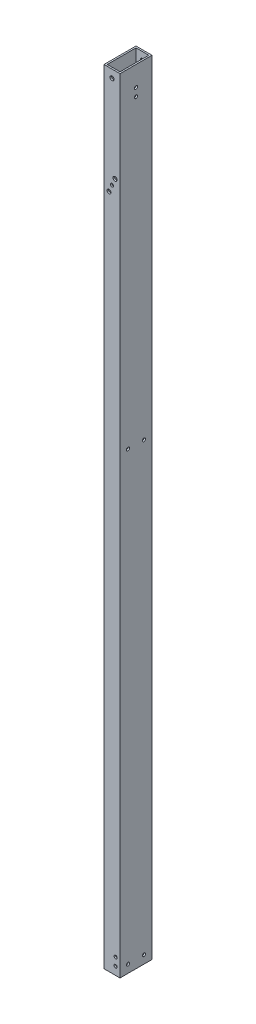
ISO-10303-21;
HEADER;
FILE_DESCRIPTION(('STEP AP214'),'2;1');
FILE_NAME('part.step','',(''),(''),'','','');
FILE_SCHEMA(('AUTOMOTIVE_DESIGN { 1 0 10303 214 1 1 1 1 }'));
ENDSEC;
DATA;
#1=APPLICATION_CONTEXT('core data for automotive mechanical design processes');
#2=APPLICATION_PROTOCOL_DEFINITION('international standard','automotive_design',2000,#1);
#3=PRODUCT_CONTEXT('',#1,'mechanical');
#4=PRODUCT('Part','Part','',(#3));
#5=PRODUCT_RELATED_PRODUCT_CATEGORY('part','',(#4));
#6=PRODUCT_DEFINITION_FORMATION('','',#4);
#7=PRODUCT_DEFINITION_CONTEXT('part definition',#1,'design');
#8=PRODUCT_DEFINITION('design','',#6,#7);
#9=PRODUCT_DEFINITION_SHAPE('','',#8);
#10=(LENGTH_UNIT() NAMED_UNIT(*) SI_UNIT(.MILLI.,.METRE.));
#11=(NAMED_UNIT(*) PLANE_ANGLE_UNIT() SI_UNIT($,.RADIAN.));
#12=(NAMED_UNIT(*) SI_UNIT($,.STERADIAN.) SOLID_ANGLE_UNIT());
#13=UNCERTAINTY_MEASURE_WITH_UNIT(LENGTH_MEASURE(1.E-05),#10,'distance_accuracy_value','');
#14=(GEOMETRIC_REPRESENTATION_CONTEXT(3) GLOBAL_UNCERTAINTY_ASSIGNED_CONTEXT((#13)) GLOBAL_UNIT_ASSIGNED_CONTEXT((#10,
#11,#12)) REPRESENTATION_CONTEXT('',''));
#15=CARTESIAN_POINT('',(0.,0.,0.));
#16=DIRECTION('',(0.,0.,1.));
#17=DIRECTION('',(1.,0.,0.));
#18=AXIS2_PLACEMENT_3D('',#15,#16,#17);
#19=CARTESIAN_POINT('',(0.,1244.6,0.));
#20=DIRECTION('',(0.,1.,0.));
#21=DIRECTION('',(0.,0.,1.));
#22=AXIS2_PLACEMENT_3D('',#19,#20,#21);
#23=PLANE('',#22);
#24=DIRECTION('',(0.,0.,1.));
#25=VECTOR('',#24,1.);
#26=CARTESIAN_POINT('',(0.,1244.6,0.));
#27=LINE('',#26,#25);
#28=CARTESIAN_POINT('',(0.,1244.6,-50.8));
#29=VERTEX_POINT('',#28);
#30=CARTESIAN_POINT('',(0.,1244.6,0.));
#31=VERTEX_POINT('',#30);
#32=EDGE_CURVE('E161',#29,#31,#27,.T.);
#33=ORIENTED_EDGE('',*,*,#32,.T.);
#34=DIRECTION('',(1.,0.,0.));
#35=VECTOR('',#34,1.);
#36=CARTESIAN_POINT('',(0.,1244.6,0.));
#37=LINE('',#36,#35);
#38=CARTESIAN_POINT('',(25.4,1244.6,0.));
#39=VERTEX_POINT('',#38);
#40=EDGE_CURVE('E164',#31,#39,#37,.T.);
#41=ORIENTED_EDGE('',*,*,#40,.T.);
#42=DIRECTION('',(0.,0.,-1.));
#43=VECTOR('',#42,1.);
#44=CARTESIAN_POINT('',(25.4,1244.6,0.));
#45=LINE('',#44,#43);
#46=CARTESIAN_POINT('',(25.4,1244.6,-50.8));
#47=VERTEX_POINT('',#46);
#48=EDGE_CURVE('E167',#39,#47,#45,.T.);
#49=ORIENTED_EDGE('',*,*,#48,.T.);
#50=DIRECTION('',(-1.,0.,0.));
#51=VECTOR('',#50,1.);
#52=CARTESIAN_POINT('',(0.,1244.6,-50.8));
#53=LINE('',#52,#51);
#54=EDGE_CURVE('E169',#47,#29,#53,.T.);
#55=ORIENTED_EDGE('',*,*,#54,.T.);
#56=EDGE_LOOP('',(#33,#41,#49,#55));
#57=FACE_BOUND('',#56,.T.);
#58=DIRECTION('',(1.,0.,0.));
#59=VECTOR('',#58,1.);
#60=CARTESIAN_POINT('',(0.,1244.6,-2.54));
#61=LINE('',#60,#59);
#62=CARTESIAN_POINT('',(2.54,1244.6,-2.54));
#63=VERTEX_POINT('',#62);
#64=CARTESIAN_POINT('',(22.86,1244.6,-2.54));
#65=VERTEX_POINT('',#64);
#66=EDGE_CURVE('E131',#63,#65,#61,.T.);
#67=ORIENTED_EDGE('',*,*,#66,.F.);
#68=DIRECTION('',(0.,0.,1.));
#69=VECTOR('',#68,1.);
#70=CARTESIAN_POINT('',(2.54,1244.6,0.));
#71=LINE('',#70,#69);
#72=CARTESIAN_POINT('',(2.54,1244.6,-48.26));
#73=VERTEX_POINT('',#72);
#74=EDGE_CURVE('E123',#73,#63,#71,.T.);
#75=ORIENTED_EDGE('',*,*,#74,.F.);
#76=DIRECTION('',(-1.,0.,0.));
#77=VECTOR('',#76,1.);
#78=CARTESIAN_POINT('',(0.,1244.6,-48.26));
#79=LINE('',#78,#77);
#80=CARTESIAN_POINT('',(22.86,1244.6,-48.26));
#81=VERTEX_POINT('',#80);
#82=EDGE_CURVE('E145',#81,#73,#79,.T.);
#83=ORIENTED_EDGE('',*,*,#82,.F.);
#84=DIRECTION('',(0.,0.,-1.));
#85=VECTOR('',#84,1.);
#86=CARTESIAN_POINT('',(22.86,1244.6,0.));
#87=LINE('',#86,#85);
#88=EDGE_CURVE('E143',#65,#81,#87,.T.);
#89=ORIENTED_EDGE('',*,*,#88,.F.);
#90=EDGE_LOOP('',(#67,#75,#83,#89));
#91=FACE_BOUND('',#90,.T.);
#92=ADVANCED_FACE('F56',(#57,#91),#23,.T.);
#93=CARTESIAN_POINT('',(0.,0.,0.));
#94=DIRECTION('',(0.,1.,0.));
#95=DIRECTION('',(0.,0.,1.));
#96=AXIS2_PLACEMENT_3D('',#93,#94,#95);
#97=PLANE('',#96);
#98=DIRECTION('',(0.,0.,1.));
#99=VECTOR('',#98,1.);
#100=CARTESIAN_POINT('',(0.,0.,0.));
#101=LINE('',#100,#99);
#102=CARTESIAN_POINT('',(0.,0.,-50.8));
#103=VERTEX_POINT('',#102);
#104=CARTESIAN_POINT('',(0.,0.,0.));
#105=VERTEX_POINT('',#104);
#106=EDGE_CURVE('E139',#103,#105,#101,.T.);
#107=ORIENTED_EDGE('',*,*,#106,.F.);
#108=DIRECTION('',(-1.,0.,0.));
#109=VECTOR('',#108,1.);
#110=CARTESIAN_POINT('',(0.,0.,-50.8));
#111=LINE('',#110,#109);
#112=CARTESIAN_POINT('',(25.4,0.,-50.8));
#113=VERTEX_POINT('',#112);
#114=EDGE_CURVE('E165',#113,#103,#111,.T.);
#115=ORIENTED_EDGE('',*,*,#114,.F.);
#116=DIRECTION('',(0.,0.,-1.));
#117=VECTOR('',#116,1.);
#118=CARTESIAN_POINT('',(25.4,0.,0.));
#119=LINE('',#118,#117);
#120=CARTESIAN_POINT('',(25.4,0.,0.));
#121=VERTEX_POINT('',#120);
#122=EDGE_CURVE('E176',#121,#113,#119,.T.);
#123=ORIENTED_EDGE('',*,*,#122,.F.);
#124=DIRECTION('',(1.,0.,0.));
#125=VECTOR('',#124,1.);
#126=CARTESIAN_POINT('',(0.,0.,0.));
#127=LINE('',#126,#125);
#128=EDGE_CURVE('E174',#105,#121,#127,.T.);
#129=ORIENTED_EDGE('',*,*,#128,.F.);
#130=EDGE_LOOP('',(#107,#115,#123,#129));
#131=FACE_BOUND('',#130,.T.);
#132=DIRECTION('',(0.,0.,1.));
#133=VECTOR('',#132,1.);
#134=CARTESIAN_POINT('',(2.54,0.,0.));
#135=LINE('',#134,#133);
#136=CARTESIAN_POINT('',(2.54,0.,-48.26));
#137=VERTEX_POINT('',#136);
#138=CARTESIAN_POINT('',(2.54,0.,-2.54));
#139=VERTEX_POINT('',#138);
#140=EDGE_CURVE('E81',#137,#139,#135,.T.);
#141=ORIENTED_EDGE('',*,*,#140,.T.);
#142=DIRECTION('',(1.,0.,0.));
#143=VECTOR('',#142,1.);
#144=CARTESIAN_POINT('',(0.,0.,-2.54));
#145=LINE('',#144,#143);
#146=CARTESIAN_POINT('',(22.86,0.,-2.54));
#147=VERTEX_POINT('',#146);
#148=EDGE_CURVE('E138',#139,#147,#145,.T.);
#149=ORIENTED_EDGE('',*,*,#148,.T.);
#150=DIRECTION('',(0.,0.,-1.));
#151=VECTOR('',#150,1.);
#152=CARTESIAN_POINT('',(22.86,0.,0.));
#153=LINE('',#152,#151);
#154=CARTESIAN_POINT('',(22.86,0.,-48.26));
#155=VERTEX_POINT('',#154);
#156=EDGE_CURVE('E153',#147,#155,#153,.T.);
#157=ORIENTED_EDGE('',*,*,#156,.T.);
#158=DIRECTION('',(-1.,0.,0.));
#159=VECTOR('',#158,1.);
#160=CARTESIAN_POINT('',(0.,0.,-48.26));
#161=LINE('',#160,#159);
#162=EDGE_CURVE('E132',#155,#137,#161,.T.);
#163=ORIENTED_EDGE('',*,*,#162,.T.);
#164=EDGE_LOOP('',(#141,#149,#157,#163));
#165=FACE_BOUND('',#164,.T.);
#166=ADVANCED_FACE('F355',(#131,#165),#97,.F.);
#167=CARTESIAN_POINT('',(0.,1244.6,0.));
#168=DIRECTION('',(1.,0.,0.));
#169=DIRECTION('',(0.,0.,-1.));
#170=AXIS2_PLACEMENT_3D('',#167,#168,#169);
#171=PLANE('',#170);
#172=CARTESIAN_POINT('',(0.,1200.15,-25.3999999999999));
#173=DIRECTION('',(-1.,0.,0.));
#174=DIRECTION('',(0.,0.,1.));
#175=AXIS2_PLACEMENT_3D('',#172,#173,#174);
#176=CIRCLE('',#175,2.48920000000002);
#177=CARTESIAN_POINT('',(0.,1200.15,-22.9107999999999));
#178=VERTEX_POINT('',#177);
#179=EDGE_CURVE('E286',#178,#178,#176,.T.);
#180=ORIENTED_EDGE('',*,*,#179,.F.);
#181=EDGE_LOOP('',(#180));
#182=FACE_BOUND('',#181,.T.);
#183=CARTESIAN_POINT('',(0.,1212.85,-25.3999999999999));
#184=DIRECTION('',(-1.,0.,0.));
#185=DIRECTION('',(0.,0.,1.));
#186=AXIS2_PLACEMENT_3D('',#183,#184,#185);
#187=CIRCLE('',#186,2.48920000000002);
#188=CARTESIAN_POINT('',(0.,1212.85,-22.9107999999999));
#189=VERTEX_POINT('',#188);
#190=EDGE_CURVE('E283',#189,#189,#187,.T.);
#191=ORIENTED_EDGE('',*,*,#190,.F.);
#192=EDGE_LOOP('',(#191));
#193=FACE_BOUND('',#192,.T.);
#194=CARTESIAN_POINT('',(0.,12.9601933725221,-38.1));
#195=DIRECTION('',(1.,0.,0.));
#196=DIRECTION('',(0.,0.,-1.));
#197=AXIS2_PLACEMENT_3D('',#194,#195,#196);
#198=CIRCLE('',#197,2.48919999999988);
#199=CARTESIAN_POINT('',(0.,12.9601933725221,-40.5891999999999));
#200=VERTEX_POINT('',#199);
#201=EDGE_CURVE('E305',#200,#200,#198,.T.);
#202=ORIENTED_EDGE('',*,*,#201,.T.);
#203=EDGE_LOOP('',(#202));
#204=FACE_BOUND('',#203,.T.);
#205=CARTESIAN_POINT('',(0.,721.632068305698,-12.7));
#206=DIRECTION('',(1.,0.,0.));
#207=DIRECTION('',(0.,0.,-1.));
#208=AXIS2_PLACEMENT_3D('',#205,#206,#207);
#209=CIRCLE('',#208,2.50189999999984);
#210=CARTESIAN_POINT('',(0.,721.632068305698,-15.2018999999998));
#211=VERTEX_POINT('',#210);
#212=EDGE_CURVE('E312',#211,#211,#209,.T.);
#213=ORIENTED_EDGE('',*,*,#212,.T.);
#214=EDGE_LOOP('',(#213));
#215=FACE_BOUND('',#214,.T.);
#216=CARTESIAN_POINT('',(0.,721.632068305698,-38.1));
#217=DIRECTION('',(1.,0.,0.));
#218=DIRECTION('',(0.,0.,-1.));
#219=AXIS2_PLACEMENT_3D('',#216,#217,#218);
#220=CIRCLE('',#219,2.50189999999983);
#221=CARTESIAN_POINT('',(0.,721.632068305698,-40.6018999999998));
#222=VERTEX_POINT('',#221);
#223=EDGE_CURVE('E299',#222,#222,#220,.T.);
#224=ORIENTED_EDGE('',*,*,#223,.T.);
#225=EDGE_LOOP('',(#224));
#226=FACE_BOUND('',#225,.T.);
#227=CARTESIAN_POINT('',(0.,12.7000000000001,-12.7));
#228=DIRECTION('',(1.,0.,0.));
#229=DIRECTION('',(0.,0.,-1.));
#230=AXIS2_PLACEMENT_3D('',#227,#228,#229);
#231=CIRCLE('',#230,2.48919999999988);
#232=CARTESIAN_POINT('',(0.,12.7000000000001,-15.1891999999999));
#233=VERTEX_POINT('',#232);
#234=EDGE_CURVE('E190',#233,#233,#231,.T.);
#235=ORIENTED_EDGE('',*,*,#234,.T.);
#236=EDGE_LOOP('',(#235));
#237=FACE_BOUND('',#236,.T.);
#238=ORIENTED_EDGE('',*,*,#106,.T.);
#239=DIRECTION('',(0.,-1.,0.));
#240=VECTOR('',#239,1.);
#241=CARTESIAN_POINT('',(0.,1244.6,0.));
#242=LINE('',#241,#240);
#243=EDGE_CURVE('E12',#31,#105,#242,.T.);
#244=ORIENTED_EDGE('',*,*,#243,.F.);
#245=ORIENTED_EDGE('',*,*,#32,.F.);
#246=DIRECTION('',(0.,-1.,0.));
#247=VECTOR('',#246,1.);
#248=CARTESIAN_POINT('',(0.,1244.6,-50.8));
#249=LINE('',#248,#247);
#250=EDGE_CURVE('E171',#29,#103,#249,.T.);
#251=ORIENTED_EDGE('',*,*,#250,.T.);
#252=EDGE_LOOP('',(#238,#244,#245,#251));
#253=FACE_BOUND('',#252,.T.);
#254=ADVANCED_FACE('F58',(#182,#193,#204,#215,#226,#237,#253),#171,.F.);
#255=CARTESIAN_POINT('',(0.,1244.6,0.));
#256=DIRECTION('',(0.,0.,-1.));
#257=DIRECTION('',(-1.,0.,0.));
#258=AXIS2_PLACEMENT_3D('',#255,#256,#257);
#259=PLANE('',#258);
#260=CARTESIAN_POINT('',(17.4625,1095.9170868,0.));
#261=DIRECTION('',(0.,0.,-1.));
#262=DIRECTION('',(-1.,0.,0.));
#263=AXIS2_PLACEMENT_3D('',#260,#261,#262);
#264=CIRCLE('',#263,3.17500000000003);
#265=CARTESIAN_POINT('',(14.2875,1095.9170868,0.));
#266=VERTEX_POINT('',#265);
#267=EDGE_CURVE('E232',#266,#266,#264,.T.);
#268=ORIENTED_EDGE('',*,*,#267,.T.);
#269=EDGE_LOOP('',(#268));
#270=FACE_BOUND('',#269,.T.);
#271=CARTESIAN_POINT('',(7.9375,1073.6920868,0.));
#272=DIRECTION('',(0.,0.,-1.));
#273=DIRECTION('',(-1.,0.,0.));
#274=AXIS2_PLACEMENT_3D('',#271,#272,#273);
#275=CIRCLE('',#274,3.17500000000003);
#276=CARTESIAN_POINT('',(4.76249999999997,1073.6920868,0.));
#277=VERTEX_POINT('',#276);
#278=EDGE_CURVE('E243',#277,#277,#275,.T.);
#279=ORIENTED_EDGE('',*,*,#278,.T.);
#280=EDGE_LOOP('',(#279));
#281=FACE_BOUND('',#280,.T.);
#282=CARTESIAN_POINT('',(12.7,1231.9,0.));
#283=DIRECTION('',(0.,0.,-1.));
#284=DIRECTION('',(-1.,0.,0.));
#285=AXIS2_PLACEMENT_3D('',#282,#283,#284);
#286=CIRCLE('',#285,3.17500000000009);
#287=CARTESIAN_POINT('',(9.52499999999991,1231.9,0.));
#288=VERTEX_POINT('',#287);
#289=EDGE_CURVE('E228',#288,#288,#286,.T.);
#290=ORIENTED_EDGE('',*,*,#289,.T.);
#291=EDGE_LOOP('',(#290));
#292=FACE_BOUND('',#291,.T.);
#293=CARTESIAN_POINT('',(18.4150000000001,12.6999999999997,0.));
#294=DIRECTION('',(0.,0.,1.));
#295=DIRECTION('',(1.,0.,0.));
#296=AXIS2_PLACEMENT_3D('',#293,#294,#295);
#297=CIRCLE('',#296,2.4892);
#298=CARTESIAN_POINT('',(20.9042000000001,12.6999999999997,0.));
#299=VERTEX_POINT('',#298);
#300=EDGE_CURVE('E264',#299,#299,#297,.T.);
#301=ORIENTED_EDGE('',*,*,#300,.F.);
#302=EDGE_LOOP('',(#301));
#303=FACE_BOUND('',#302,.T.);
#304=CARTESIAN_POINT('',(18.4150000000001,25.3999999999997,0.));
#305=DIRECTION('',(0.,0.,1.));
#306=DIRECTION('',(1.,0.,0.));
#307=AXIS2_PLACEMENT_3D('',#304,#305,#306);
#308=CIRCLE('',#307,2.4892);
#309=CARTESIAN_POINT('',(20.9042000000001,25.3999999999997,0.));
#310=VERTEX_POINT('',#309);
#311=EDGE_CURVE('E261',#310,#310,#308,.T.);
#312=ORIENTED_EDGE('',*,*,#311,.F.);
#313=EDGE_LOOP('',(#312));
#314=FACE_BOUND('',#313,.T.);
#315=CARTESIAN_POINT('',(12.7,1084.8045868,0.));
#316=DIRECTION('',(0.,0.,-1.));
#317=DIRECTION('',(-1.,0.,0.));
#318=AXIS2_PLACEMENT_3D('',#315,#316,#317);
#319=CIRCLE('',#318,2.48920000000001);
#320=CARTESIAN_POINT('',(10.2108,1084.8045868,0.));
#321=VERTEX_POINT('',#320);
#322=EDGE_CURVE('E215',#321,#321,#319,.T.);
#323=ORIENTED_EDGE('',*,*,#322,.T.);
#324=EDGE_LOOP('',(#323));
#325=FACE_BOUND('',#324,.T.);
#326=ORIENTED_EDGE('',*,*,#128,.T.);
#327=DIRECTION('',(0.,-1.,0.));
#328=VECTOR('',#327,1.);
#329=CARTESIAN_POINT('',(25.4,1244.6,0.));
#330=LINE('',#329,#328);
#331=EDGE_CURVE('E65',#39,#121,#330,.T.);
#332=ORIENTED_EDGE('',*,*,#331,.F.);
#333=ORIENTED_EDGE('',*,*,#40,.F.);
#334=ORIENTED_EDGE('',*,*,#243,.T.);
#335=EDGE_LOOP('',(#326,#332,#333,#334));
#336=FACE_BOUND('',#335,.T.);
#337=ADVANCED_FACE('F354',(#270,#281,#292,#303,#314,#325,#336),#259,.F.);
#338=CARTESIAN_POINT('',(25.4,1244.6,0.));
#339=DIRECTION('',(-1.,0.,0.));
#340=DIRECTION('',(0.,0.,1.));
#341=AXIS2_PLACEMENT_3D('',#338,#339,#340);
#342=PLANE('',#341);
#343=CARTESIAN_POINT('',(25.4,1200.15,-25.3999999999999));
#344=DIRECTION('',(-1.,0.,0.));
#345=DIRECTION('',(0.,0.,1.));
#346=AXIS2_PLACEMENT_3D('',#343,#344,#345);
#347=CIRCLE('',#346,2.48920000000002);
#348=CARTESIAN_POINT('',(25.4,1200.15,-22.9107999999999));
#349=VERTEX_POINT('',#348);
#350=EDGE_CURVE('E206',#349,#349,#347,.T.);
#351=ORIENTED_EDGE('',*,*,#350,.T.);
#352=EDGE_LOOP('',(#351));
#353=FACE_BOUND('',#352,.T.);
#354=CARTESIAN_POINT('',(25.4,1212.85,-25.3999999999999));
#355=DIRECTION('',(-1.,0.,0.));
#356=DIRECTION('',(0.,0.,1.));
#357=AXIS2_PLACEMENT_3D('',#354,#355,#356);
#358=CIRCLE('',#357,2.48920000000002);
#359=CARTESIAN_POINT('',(25.4,1212.85,-22.9107999999999));
#360=VERTEX_POINT('',#359);
#361=EDGE_CURVE('E289',#360,#360,#358,.T.);
#362=ORIENTED_EDGE('',*,*,#361,.T.);
#363=EDGE_LOOP('',(#362));
#364=FACE_BOUND('',#363,.T.);
#365=CARTESIAN_POINT('',(25.4,12.9601933725221,-38.1));
#366=DIRECTION('',(1.,0.,0.));
#367=DIRECTION('',(0.,0.,-1.));
#368=AXIS2_PLACEMENT_3D('',#365,#366,#367);
#369=CIRCLE('',#368,2.48919999999988);
#370=CARTESIAN_POINT('',(25.4,12.9601933725221,-40.5891999999999));
#371=VERTEX_POINT('',#370);
#372=EDGE_CURVE('E309',#371,#371,#369,.T.);
#373=ORIENTED_EDGE('',*,*,#372,.F.);
#374=EDGE_LOOP('',(#373));
#375=FACE_BOUND('',#374,.T.);
#376=CARTESIAN_POINT('',(25.4,721.632068305698,-12.7));
#377=DIRECTION('',(1.,0.,0.));
#378=DIRECTION('',(0.,0.,-1.));
#379=AXIS2_PLACEMENT_3D('',#376,#377,#378);
#380=CIRCLE('',#379,2.50189999999984);
#381=CARTESIAN_POINT('',(25.4,721.632068305698,-15.2018999999998));
#382=VERTEX_POINT('',#381);
#383=EDGE_CURVE('E302',#382,#382,#380,.T.);
#384=ORIENTED_EDGE('',*,*,#383,.F.);
#385=EDGE_LOOP('',(#384));
#386=FACE_BOUND('',#385,.T.);
#387=CARTESIAN_POINT('',(25.4,721.632068305698,-38.1));
#388=DIRECTION('',(1.,0.,0.));
#389=DIRECTION('',(0.,0.,-1.));
#390=AXIS2_PLACEMENT_3D('',#387,#388,#389);
#391=CIRCLE('',#390,2.50189999999983);
#392=CARTESIAN_POINT('',(25.4,721.632068305698,-40.6018999999998));
#393=VERTEX_POINT('',#392);
#394=EDGE_CURVE('E298',#393,#393,#391,.T.);
#395=ORIENTED_EDGE('',*,*,#394,.F.);
#396=EDGE_LOOP('',(#395));
#397=FACE_BOUND('',#396,.T.);
#398=CARTESIAN_POINT('',(25.4,12.7000000000001,-12.7));
#399=DIRECTION('',(1.,0.,0.));
#400=DIRECTION('',(0.,0.,-1.));
#401=AXIS2_PLACEMENT_3D('',#398,#399,#400);
#402=CIRCLE('',#401,2.48919999999988);
#403=CARTESIAN_POINT('',(25.4,12.7000000000001,-15.1891999999999));
#404=VERTEX_POINT('',#403);
#405=EDGE_CURVE('E308',#404,#404,#402,.T.);
#406=ORIENTED_EDGE('',*,*,#405,.F.);
#407=EDGE_LOOP('',(#406));
#408=FACE_BOUND('',#407,.T.);
#409=ORIENTED_EDGE('',*,*,#122,.T.);
#410=DIRECTION('',(0.,-1.,0.));
#411=VECTOR('',#410,1.);
#412=CARTESIAN_POINT('',(25.4,1244.6,-50.8));
#413=LINE('',#412,#411);
#414=EDGE_CURVE('E181',#47,#113,#413,.T.);
#415=ORIENTED_EDGE('',*,*,#414,.F.);
#416=ORIENTED_EDGE('',*,*,#48,.F.);
#417=ORIENTED_EDGE('',*,*,#331,.T.);
#418=EDGE_LOOP('',(#409,#415,#416,#417));
#419=FACE_BOUND('',#418,.T.);
#420=ADVANCED_FACE('F373',(#353,#364,#375,#386,#397,#408,#419),#342,.F.);
#421=CARTESIAN_POINT('',(0.,1244.6,-50.8));
#422=DIRECTION('',(0.,0.,1.));
#423=DIRECTION('',(1.,0.,0.));
#424=AXIS2_PLACEMENT_3D('',#421,#422,#423);
#425=PLANE('',#424);
#426=CARTESIAN_POINT('',(17.4625,1095.9170868,-50.8));
#427=DIRECTION('',(0.,0.,-1.));
#428=DIRECTION('',(-1.,0.,0.));
#429=AXIS2_PLACEMENT_3D('',#426,#427,#428);
#430=CIRCLE('',#429,3.17500000000003);
#431=CARTESIAN_POINT('',(14.2875,1095.9170868,-50.8));
#432=VERTEX_POINT('',#431);
#433=EDGE_CURVE('E238',#432,#432,#430,.T.);
#434=ORIENTED_EDGE('',*,*,#433,.F.);
#435=EDGE_LOOP('',(#434));
#436=FACE_BOUND('',#435,.T.);
#437=CARTESIAN_POINT('',(7.9375,1073.6920868,-50.8));
#438=DIRECTION('',(0.,0.,-1.));
#439=DIRECTION('',(-1.,0.,0.));
#440=AXIS2_PLACEMENT_3D('',#437,#438,#439);
#441=CIRCLE('',#440,3.17500000000003);
#442=CARTESIAN_POINT('',(4.76249999999997,1073.6920868,-50.8));
#443=VERTEX_POINT('',#442);
#444=EDGE_CURVE('E248',#443,#443,#441,.T.);
#445=ORIENTED_EDGE('',*,*,#444,.F.);
#446=EDGE_LOOP('',(#445));
#447=FACE_BOUND('',#446,.T.);
#448=CARTESIAN_POINT('',(12.7,1231.9,-50.8));
#449=DIRECTION('',(0.,0.,-1.));
#450=DIRECTION('',(-1.,0.,0.));
#451=AXIS2_PLACEMENT_3D('',#448,#449,#450);
#452=CIRCLE('',#451,3.17500000000009);
#453=CARTESIAN_POINT('',(9.52499999999991,1231.9,-50.8));
#454=VERTEX_POINT('',#453);
#455=EDGE_CURVE('E254',#454,#454,#452,.T.);
#456=ORIENTED_EDGE('',*,*,#455,.F.);
#457=EDGE_LOOP('',(#456));
#458=FACE_BOUND('',#457,.T.);
#459=CARTESIAN_POINT('',(18.4150000000001,12.6999999999997,-50.8));
#460=DIRECTION('',(0.,0.,1.));
#461=DIRECTION('',(1.,0.,0.));
#462=AXIS2_PLACEMENT_3D('',#459,#460,#461);
#463=CIRCLE('',#462,2.4892);
#464=CARTESIAN_POINT('',(20.9042000000001,12.6999999999997,-50.8));
#465=VERTEX_POINT('',#464);
#466=EDGE_CURVE('E220',#465,#465,#463,.T.);
#467=ORIENTED_EDGE('',*,*,#466,.T.);
#468=EDGE_LOOP('',(#467));
#469=FACE_BOUND('',#468,.T.);
#470=CARTESIAN_POINT('',(18.4150000000001,25.3999999999997,-50.8));
#471=DIRECTION('',(0.,0.,1.));
#472=DIRECTION('',(1.,0.,0.));
#473=AXIS2_PLACEMENT_3D('',#470,#471,#472);
#474=CIRCLE('',#473,2.4892);
#475=CARTESIAN_POINT('',(20.9042000000001,25.3999999999997,-50.8));
#476=VERTEX_POINT('',#475);
#477=EDGE_CURVE('E267',#476,#476,#474,.T.);
#478=ORIENTED_EDGE('',*,*,#477,.T.);
#479=EDGE_LOOP('',(#478));
#480=FACE_BOUND('',#479,.T.);
#481=CARTESIAN_POINT('',(12.7,1084.8045868,-50.8));
#482=DIRECTION('',(0.,0.,-1.));
#483=DIRECTION('',(-1.,0.,0.));
#484=AXIS2_PLACEMENT_3D('',#481,#482,#483);
#485=CIRCLE('',#484,2.48920000000001);
#486=CARTESIAN_POINT('',(10.2108,1084.8045868,-50.8));
#487=VERTEX_POINT('',#486);
#488=EDGE_CURVE('E276',#487,#487,#485,.T.);
#489=ORIENTED_EDGE('',*,*,#488,.F.);
#490=EDGE_LOOP('',(#489));
#491=FACE_BOUND('',#490,.T.);
#492=ORIENTED_EDGE('',*,*,#114,.T.);
#493=ORIENTED_EDGE('',*,*,#250,.F.);
#494=ORIENTED_EDGE('',*,*,#54,.F.);
#495=ORIENTED_EDGE('',*,*,#414,.T.);
#496=EDGE_LOOP('',(#492,#493,#494,#495));
#497=FACE_BOUND('',#496,.T.);
#498=ADVANCED_FACE('F334',(#436,#447,#458,#469,#480,#491,#497),#425,.F.);
#499=CARTESIAN_POINT('',(2.54,1244.6,0.));
#500=DIRECTION('',(1.,0.,0.));
#501=DIRECTION('',(0.,0.,-1.));
#502=AXIS2_PLACEMENT_3D('',#499,#500,#501);
#503=PLANE('',#502);
#504=CARTESIAN_POINT('',(2.54,1200.15,-25.3999999999999));
#505=DIRECTION('',(1.,0.,0.));
#506=DIRECTION('',(0.,0.,-1.));
#507=AXIS2_PLACEMENT_3D('',#504,#505,#506);
#508=CIRCLE('',#507,2.48920000000002);
#509=CARTESIAN_POINT('',(2.54,1200.15,-27.8892));
#510=VERTEX_POINT('',#509);
#511=EDGE_CURVE('E210',#510,#510,#508,.T.);
#512=ORIENTED_EDGE('',*,*,#511,.F.);
#513=EDGE_LOOP('',(#512));
#514=FACE_BOUND('',#513,.T.);
#515=CARTESIAN_POINT('',(2.54,1212.85,-25.3999999999999));
#516=DIRECTION('',(1.,0.,0.));
#517=DIRECTION('',(0.,0.,-1.));
#518=AXIS2_PLACEMENT_3D('',#515,#516,#517);
#519=CIRCLE('',#518,2.48920000000002);
#520=CARTESIAN_POINT('',(2.54,1212.85,-27.8892));
#521=VERTEX_POINT('',#520);
#522=EDGE_CURVE('E205',#521,#521,#519,.T.);
#523=ORIENTED_EDGE('',*,*,#522,.F.);
#524=EDGE_LOOP('',(#523));
#525=FACE_BOUND('',#524,.T.);
#526=CARTESIAN_POINT('',(2.54,12.9601933725221,-38.1));
#527=DIRECTION('',(1.,0.,0.));
#528=DIRECTION('',(0.,0.,-1.));
#529=AXIS2_PLACEMENT_3D('',#526,#527,#528);
#530=CIRCLE('',#529,2.48919999999988);
#531=CARTESIAN_POINT('',(2.54,12.9601933725221,-40.5891999999999));
#532=VERTEX_POINT('',#531);
#533=EDGE_CURVE('E151',#532,#532,#530,.T.);
#534=ORIENTED_EDGE('',*,*,#533,.F.);
#535=EDGE_LOOP('',(#534));
#536=FACE_BOUND('',#535,.T.);
#537=CARTESIAN_POINT('',(2.54,721.632068305698,-12.7));
#538=DIRECTION('',(1.,0.,0.));
#539=DIRECTION('',(0.,0.,-1.));
#540=AXIS2_PLACEMENT_3D('',#537,#538,#539);
#541=CIRCLE('',#540,2.50189999999984);
#542=CARTESIAN_POINT('',(2.54,721.632068305698,-15.2018999999998));
#543=VERTEX_POINT('',#542);
#544=EDGE_CURVE('E198',#543,#543,#541,.T.);
#545=ORIENTED_EDGE('',*,*,#544,.F.);
#546=EDGE_LOOP('',(#545));
#547=FACE_BOUND('',#546,.T.);
#548=CARTESIAN_POINT('',(2.54,721.632068305698,-38.1));
#549=DIRECTION('',(1.,0.,0.));
#550=DIRECTION('',(0.,0.,-1.));
#551=AXIS2_PLACEMENT_3D('',#548,#549,#550);
#552=CIRCLE('',#551,2.50189999999983);
#553=CARTESIAN_POINT('',(2.54,721.632068305698,-40.6018999999998));
#554=VERTEX_POINT('',#553);
#555=EDGE_CURVE('E194',#554,#554,#552,.T.);
#556=ORIENTED_EDGE('',*,*,#555,.F.);
#557=EDGE_LOOP('',(#556));
#558=FACE_BOUND('',#557,.T.);
#559=CARTESIAN_POINT('',(2.54,12.7000000000001,-12.7));
#560=DIRECTION('',(1.,0.,0.));
#561=DIRECTION('',(0.,0.,-1.));
#562=AXIS2_PLACEMENT_3D('',#559,#560,#561);
#563=CIRCLE('',#562,2.48919999999988);
#564=CARTESIAN_POINT('',(2.54,12.7000000000001,-15.1891999999999));
#565=VERTEX_POINT('',#564);
#566=EDGE_CURVE('E189',#565,#565,#563,.T.);
#567=ORIENTED_EDGE('',*,*,#566,.F.);
#568=EDGE_LOOP('',(#567));
#569=FACE_BOUND('',#568,.T.);
#570=ORIENTED_EDGE('',*,*,#140,.F.);
#571=DIRECTION('',(0.,-1.,0.));
#572=VECTOR('',#571,1.);
#573=CARTESIAN_POINT('',(2.54,1244.6,-48.26));
#574=LINE('',#573,#572);
#575=EDGE_CURVE('E127',#73,#137,#574,.T.);
#576=ORIENTED_EDGE('',*,*,#575,.F.);
#577=ORIENTED_EDGE('',*,*,#74,.T.);
#578=DIRECTION('',(0.,-1.,0.));
#579=VECTOR('',#578,1.);
#580=CARTESIAN_POINT('',(2.54,1244.6,-2.54));
#581=LINE('',#580,#579);
#582=EDGE_CURVE('E126',#63,#139,#581,.T.);
#583=ORIENTED_EDGE('',*,*,#582,.T.);
#584=EDGE_LOOP('',(#570,#576,#577,#583));
#585=FACE_BOUND('',#584,.T.);
#586=ADVANCED_FACE('F125',(#514,#525,#536,#547,#558,#569,#585),#503,.T.);
#587=CARTESIAN_POINT('',(0.,1244.6,-2.54));
#588=DIRECTION('',(0.,0.,-1.));
#589=DIRECTION('',(-1.,0.,0.));
#590=AXIS2_PLACEMENT_3D('',#587,#588,#589);
#591=PLANE('',#590);
#592=CARTESIAN_POINT('',(17.4625,1095.9170868,-2.54));
#593=DIRECTION('',(0.,0.,-1.));
#594=DIRECTION('',(-1.,0.,0.));
#595=AXIS2_PLACEMENT_3D('',#592,#593,#594);
#596=CIRCLE('',#595,3.17500000000003);
#597=CARTESIAN_POINT('',(14.2875,1095.9170868,-2.54));
#598=VERTEX_POINT('',#597);
#599=EDGE_CURVE('E251',#598,#598,#596,.T.);
#600=ORIENTED_EDGE('',*,*,#599,.F.);
#601=EDGE_LOOP('',(#600));
#602=FACE_BOUND('',#601,.T.);
#603=CARTESIAN_POINT('',(7.9375,1073.6920868,-2.54));
#604=DIRECTION('',(0.,0.,-1.));
#605=DIRECTION('',(-1.,0.,0.));
#606=AXIS2_PLACEMENT_3D('',#603,#604,#605);
#607=CIRCLE('',#606,3.17500000000003);
#608=CARTESIAN_POINT('',(4.76249999999997,1073.6920868,-2.54));
#609=VERTEX_POINT('',#608);
#610=EDGE_CURVE('E231',#609,#609,#607,.T.);
#611=ORIENTED_EDGE('',*,*,#610,.F.);
#612=EDGE_LOOP('',(#611));
#613=FACE_BOUND('',#612,.T.);
#614=CARTESIAN_POINT('',(12.7,1231.9,-2.54));
#615=DIRECTION('',(0.,0.,-1.));
#616=DIRECTION('',(-1.,0.,0.));
#617=AXIS2_PLACEMENT_3D('',#614,#615,#616);
#618=CIRCLE('',#617,3.17500000000009);
#619=CARTESIAN_POINT('',(9.52499999999991,1231.9,-2.54));
#620=VERTEX_POINT('',#619);
#621=EDGE_CURVE('E227',#620,#620,#618,.T.);
#622=ORIENTED_EDGE('',*,*,#621,.F.);
#623=EDGE_LOOP('',(#622));
#624=FACE_BOUND('',#623,.T.);
#625=CARTESIAN_POINT('',(18.4150000000001,12.6999999999997,-2.54));
#626=DIRECTION('',(0.,0.,-1.));
#627=DIRECTION('',(-1.,0.,0.));
#628=AXIS2_PLACEMENT_3D('',#625,#626,#627);
#629=CIRCLE('',#628,2.4892);
#630=CARTESIAN_POINT('',(15.9258000000001,12.6999999999997,-2.54));
#631=VERTEX_POINT('',#630);
#632=EDGE_CURVE('E224',#631,#631,#629,.T.);
#633=ORIENTED_EDGE('',*,*,#632,.F.);
#634=EDGE_LOOP('',(#633));
#635=FACE_BOUND('',#634,.T.);
#636=CARTESIAN_POINT('',(18.4150000000001,25.3999999999997,-2.54));
#637=DIRECTION('',(0.,0.,-1.));
#638=DIRECTION('',(-1.,0.,0.));
#639=AXIS2_PLACEMENT_3D('',#636,#637,#638);
#640=CIRCLE('',#639,2.4892);
#641=CARTESIAN_POINT('',(15.9258000000001,25.3999999999997,-2.54));
#642=VERTEX_POINT('',#641);
#643=EDGE_CURVE('E219',#642,#642,#640,.T.);
#644=ORIENTED_EDGE('',*,*,#643,.F.);
#645=EDGE_LOOP('',(#644));
#646=FACE_BOUND('',#645,.T.);
#647=CARTESIAN_POINT('',(12.7,1084.8045868,-2.54));
#648=DIRECTION('',(0.,0.,-1.));
#649=DIRECTION('',(-1.,0.,0.));
#650=AXIS2_PLACEMENT_3D('',#647,#648,#649);
#651=CIRCLE('',#650,2.48920000000001);
#652=CARTESIAN_POINT('',(10.2108,1084.8045868,-2.54));
#653=VERTEX_POINT('',#652);
#654=EDGE_CURVE('E214',#653,#653,#651,.T.);
#655=ORIENTED_EDGE('',*,*,#654,.F.);
#656=EDGE_LOOP('',(#655));
#657=FACE_BOUND('',#656,.T.);
#658=ORIENTED_EDGE('',*,*,#148,.F.);
#659=ORIENTED_EDGE('',*,*,#582,.F.);
#660=ORIENTED_EDGE('',*,*,#66,.T.);
#661=DIRECTION('',(0.,-1.,0.));
#662=VECTOR('',#661,1.);
#663=CARTESIAN_POINT('',(22.86,1244.6,-2.54));
#664=LINE('',#663,#662);
#665=EDGE_CURVE('E140',#65,#147,#664,.T.);
#666=ORIENTED_EDGE('',*,*,#665,.T.);
#667=EDGE_LOOP('',(#658,#659,#660,#666));
#668=FACE_BOUND('',#667,.T.);
#669=ADVANCED_FACE('F135',(#602,#613,#624,#635,#646,#657,#668),#591,.T.);
#670=CARTESIAN_POINT('',(22.86,1244.6,0.));
#671=DIRECTION('',(-1.,0.,0.));
#672=DIRECTION('',(0.,0.,1.));
#673=AXIS2_PLACEMENT_3D('',#670,#671,#672);
#674=PLANE('',#673);
#675=CARTESIAN_POINT('',(22.86,1200.15,-25.3999999999999));
#676=DIRECTION('',(-1.,0.,0.));
#677=DIRECTION('',(0.,0.,1.));
#678=AXIS2_PLACEMENT_3D('',#675,#676,#677);
#679=CIRCLE('',#678,2.48920000000002);
#680=CARTESIAN_POINT('',(22.86,1200.15,-22.9107999999999));
#681=VERTEX_POINT('',#680);
#682=EDGE_CURVE('E207',#681,#681,#679,.T.);
#683=ORIENTED_EDGE('',*,*,#682,.F.);
#684=EDGE_LOOP('',(#683));
#685=FACE_BOUND('',#684,.T.);
#686=CARTESIAN_POINT('',(22.86,1212.85,-25.3999999999999));
#687=DIRECTION('',(-1.,0.,0.));
#688=DIRECTION('',(0.,0.,1.));
#689=AXIS2_PLACEMENT_3D('',#686,#687,#688);
#690=CIRCLE('',#689,2.48920000000002);
#691=CARTESIAN_POINT('',(22.86,1212.85,-22.9107999999999));
#692=VERTEX_POINT('',#691);
#693=EDGE_CURVE('E202',#692,#692,#690,.T.);
#694=ORIENTED_EDGE('',*,*,#693,.F.);
#695=EDGE_LOOP('',(#694));
#696=FACE_BOUND('',#695,.T.);
#697=CARTESIAN_POINT('',(22.86,12.9601933725221,-38.1));
#698=DIRECTION('',(-1.,0.,0.));
#699=DIRECTION('',(0.,0.,1.));
#700=AXIS2_PLACEMENT_3D('',#697,#698,#699);
#701=CIRCLE('',#700,2.48919999999988);
#702=CARTESIAN_POINT('',(22.86,12.9601933725221,-35.6108000000002));
#703=VERTEX_POINT('',#702);
#704=EDGE_CURVE('E199',#703,#703,#701,.T.);
#705=ORIENTED_EDGE('',*,*,#704,.F.);
#706=EDGE_LOOP('',(#705));
#707=FACE_BOUND('',#706,.T.);
#708=CARTESIAN_POINT('',(22.86,721.632068305698,-12.7));
#709=DIRECTION('',(-1.,0.,0.));
#710=DIRECTION('',(0.,0.,1.));
#711=AXIS2_PLACEMENT_3D('',#708,#709,#710);
#712=CIRCLE('',#711,2.50189999999984);
#713=CARTESIAN_POINT('',(22.86,721.632068305698,-10.1981000000002));
#714=VERTEX_POINT('',#713);
#715=EDGE_CURVE('E195',#714,#714,#712,.T.);
#716=ORIENTED_EDGE('',*,*,#715,.F.);
#717=EDGE_LOOP('',(#716));
#718=FACE_BOUND('',#717,.T.);
#719=CARTESIAN_POINT('',(22.86,721.632068305698,-38.1));
#720=DIRECTION('',(-1.,0.,0.));
#721=DIRECTION('',(0.,0.,1.));
#722=AXIS2_PLACEMENT_3D('',#719,#720,#721);
#723=CIRCLE('',#722,2.50189999999983);
#724=CARTESIAN_POINT('',(22.86,721.632068305698,-35.5981000000002));
#725=VERTEX_POINT('',#724);
#726=EDGE_CURVE('E191',#725,#725,#723,.T.);
#727=ORIENTED_EDGE('',*,*,#726,.F.);
#728=EDGE_LOOP('',(#727));
#729=FACE_BOUND('',#728,.T.);
#730=CARTESIAN_POINT('',(22.86,12.7000000000001,-12.7));
#731=DIRECTION('',(-1.,0.,0.));
#732=DIRECTION('',(0.,0.,1.));
#733=AXIS2_PLACEMENT_3D('',#730,#731,#732);
#734=CIRCLE('',#733,2.48919999999988);
#735=CARTESIAN_POINT('',(22.86,12.7000000000001,-10.2108000000002));
#736=VERTEX_POINT('',#735);
#737=EDGE_CURVE('E186',#736,#736,#734,.T.);
#738=ORIENTED_EDGE('',*,*,#737,.F.);
#739=EDGE_LOOP('',(#738));
#740=FACE_BOUND('',#739,.T.);
#741=ORIENTED_EDGE('',*,*,#156,.F.);
#742=ORIENTED_EDGE('',*,*,#665,.F.);
#743=ORIENTED_EDGE('',*,*,#88,.T.);
#744=DIRECTION('',(0.,-1.,0.));
#745=VECTOR('',#744,1.);
#746=CARTESIAN_POINT('',(22.86,1244.6,-48.26));
#747=LINE('',#746,#745);
#748=EDGE_CURVE('E73',#81,#155,#747,.T.);
#749=ORIENTED_EDGE('',*,*,#748,.T.);
#750=EDGE_LOOP('',(#741,#742,#743,#749));
#751=FACE_BOUND('',#750,.T.);
#752=ADVANCED_FACE('F393',(#685,#696,#707,#718,#729,#740,#751),#674,.T.);
#753=CARTESIAN_POINT('',(0.,1244.6,-48.26));
#754=DIRECTION('',(0.,0.,1.));
#755=DIRECTION('',(1.,0.,0.));
#756=AXIS2_PLACEMENT_3D('',#753,#754,#755);
#757=PLANE('',#756);
#758=CARTESIAN_POINT('',(17.4625,1095.9170868,-48.26));
#759=DIRECTION('',(0.,0.,1.));
#760=DIRECTION('',(1.,0.,0.));
#761=AXIS2_PLACEMENT_3D('',#758,#759,#760);
#762=CIRCLE('',#761,3.17500000000003);
#763=CARTESIAN_POINT('',(20.6375,1095.9170868,-48.26));
#764=VERTEX_POINT('',#763);
#765=EDGE_CURVE('E60',#764,#764,#762,.T.);
#766=ORIENTED_EDGE('',*,*,#765,.F.);
#767=EDGE_LOOP('',(#766));
#768=FACE_BOUND('',#767,.T.);
#769=CARTESIAN_POINT('',(7.9375,1073.6920868,-48.26));
#770=DIRECTION('',(0.,0.,1.));
#771=DIRECTION('',(1.,0.,0.));
#772=AXIS2_PLACEMENT_3D('',#769,#770,#771);
#773=CIRCLE('',#772,3.17500000000003);
#774=CARTESIAN_POINT('',(11.1125,1073.6920868,-48.26));
#775=VERTEX_POINT('',#774);
#776=EDGE_CURVE('E229',#775,#775,#773,.T.);
#777=ORIENTED_EDGE('',*,*,#776,.F.);
#778=EDGE_LOOP('',(#777));
#779=FACE_BOUND('',#778,.T.);
#780=CARTESIAN_POINT('',(12.7,1231.9,-48.26));
#781=DIRECTION('',(0.,0.,1.));
#782=DIRECTION('',(1.,0.,0.));
#783=AXIS2_PLACEMENT_3D('',#780,#781,#782);
#784=CIRCLE('',#783,3.17500000000009);
#785=CARTESIAN_POINT('',(15.8750000000001,1231.9,-48.26));
#786=VERTEX_POINT('',#785);
#787=EDGE_CURVE('E225',#786,#786,#784,.T.);
#788=ORIENTED_EDGE('',*,*,#787,.F.);
#789=EDGE_LOOP('',(#788));
#790=FACE_BOUND('',#789,.T.);
#791=CARTESIAN_POINT('',(18.4150000000001,12.6999999999997,-48.26));
#792=DIRECTION('',(0.,0.,1.));
#793=DIRECTION('',(1.,0.,0.));
#794=AXIS2_PLACEMENT_3D('',#791,#792,#793);
#795=CIRCLE('',#794,2.4892);
#796=CARTESIAN_POINT('',(20.9042000000001,12.6999999999997,-48.26));
#797=VERTEX_POINT('',#796);
#798=EDGE_CURVE('E221',#797,#797,#795,.T.);
#799=ORIENTED_EDGE('',*,*,#798,.F.);
#800=EDGE_LOOP('',(#799));
#801=FACE_BOUND('',#800,.T.);
#802=CARTESIAN_POINT('',(18.4150000000001,25.3999999999997,-48.26));
#803=DIRECTION('',(0.,0.,1.));
#804=DIRECTION('',(1.,0.,0.));
#805=AXIS2_PLACEMENT_3D('',#802,#803,#804);
#806=CIRCLE('',#805,2.4892);
#807=CARTESIAN_POINT('',(20.9042000000001,25.3999999999997,-48.26));
#808=VERTEX_POINT('',#807);
#809=EDGE_CURVE('E216',#808,#808,#806,.T.);
#810=ORIENTED_EDGE('',*,*,#809,.F.);
#811=EDGE_LOOP('',(#810));
#812=FACE_BOUND('',#811,.T.);
#813=CARTESIAN_POINT('',(12.7,1084.8045868,-48.26));
#814=DIRECTION('',(0.,0.,1.));
#815=DIRECTION('',(1.,0.,0.));
#816=AXIS2_PLACEMENT_3D('',#813,#814,#815);
#817=CIRCLE('',#816,2.48920000000001);
#818=CARTESIAN_POINT('',(15.1892,1084.8045868,-48.26));
#819=VERTEX_POINT('',#818);
#820=EDGE_CURVE('E211',#819,#819,#817,.T.);
#821=ORIENTED_EDGE('',*,*,#820,.F.);
#822=EDGE_LOOP('',(#821));
#823=FACE_BOUND('',#822,.T.);
#824=ORIENTED_EDGE('',*,*,#162,.F.);
#825=ORIENTED_EDGE('',*,*,#748,.F.);
#826=ORIENTED_EDGE('',*,*,#82,.T.);
#827=ORIENTED_EDGE('',*,*,#575,.T.);
#828=EDGE_LOOP('',(#824,#825,#826,#827));
#829=FACE_BOUND('',#828,.T.);
#830=ADVANCED_FACE('F397',(#768,#779,#790,#801,#812,#823,#829),#757,.T.);
#831=CARTESIAN_POINT('',(0.,12.7000000000001,-12.7));
#832=DIRECTION('',(1.,0.,0.));
#833=DIRECTION('',(0.,0.,-1.));
#834=AXIS2_PLACEMENT_3D('',#831,#832,#833);
#835=CYLINDRICAL_SURFACE('',#834,2.48919999999988);
#836=ORIENTED_EDGE('',*,*,#737,.T.);
#837=EDGE_LOOP('',(#836));
#838=FACE_BOUND('',#837,.T.);
#839=ORIENTED_EDGE('',*,*,#405,.T.);
#840=EDGE_LOOP('',(#839));
#841=FACE_BOUND('',#840,.T.);
#842=ADVANCED_FACE('F349',(#838,#841),#835,.F.);
#843=CARTESIAN_POINT('',(0.,721.632068305698,-38.1));
#844=DIRECTION('',(1.,0.,0.));
#845=DIRECTION('',(0.,0.,-1.));
#846=AXIS2_PLACEMENT_3D('',#843,#844,#845);
#847=CYLINDRICAL_SURFACE('',#846,2.50189999999983);
#848=ORIENTED_EDGE('',*,*,#726,.T.);
#849=EDGE_LOOP('',(#848));
#850=FACE_BOUND('',#849,.T.);
#851=ORIENTED_EDGE('',*,*,#394,.T.);
#852=EDGE_LOOP('',(#851));
#853=FACE_BOUND('',#852,.T.);
#854=ADVANCED_FACE('F403',(#850,#853),#847,.F.);
#855=CARTESIAN_POINT('',(0.,721.632068305698,-12.7));
#856=DIRECTION('',(1.,0.,0.));
#857=DIRECTION('',(0.,0.,-1.));
#858=AXIS2_PLACEMENT_3D('',#855,#856,#857);
#859=CYLINDRICAL_SURFACE('',#858,2.50189999999984);
#860=ORIENTED_EDGE('',*,*,#715,.T.);
#861=EDGE_LOOP('',(#860));
#862=FACE_BOUND('',#861,.T.);
#863=ORIENTED_EDGE('',*,*,#383,.T.);
#864=EDGE_LOOP('',(#863));
#865=FACE_BOUND('',#864,.T.);
#866=ADVANCED_FACE('F405',(#862,#865),#859,.F.);
#867=CARTESIAN_POINT('',(0.,12.9601933725221,-38.1));
#868=DIRECTION('',(1.,0.,0.));
#869=DIRECTION('',(0.,0.,-1.));
#870=AXIS2_PLACEMENT_3D('',#867,#868,#869);
#871=CYLINDRICAL_SURFACE('',#870,2.48919999999988);
#872=ORIENTED_EDGE('',*,*,#704,.T.);
#873=EDGE_LOOP('',(#872));
#874=FACE_BOUND('',#873,.T.);
#875=ORIENTED_EDGE('',*,*,#372,.T.);
#876=EDGE_LOOP('',(#875));
#877=FACE_BOUND('',#876,.T.);
#878=ADVANCED_FACE('F347',(#874,#877),#871,.F.);
#879=ORIENTED_EDGE('',*,*,#566,.T.);
#880=EDGE_LOOP('',(#879));
#881=FACE_BOUND('',#880,.T.);
#882=ORIENTED_EDGE('',*,*,#234,.F.);
#883=EDGE_LOOP('',(#882));
#884=FACE_BOUND('',#883,.T.);
#885=ADVANCED_FACE('F343',(#881,#884),#835,.F.);
#886=ORIENTED_EDGE('',*,*,#555,.T.);
#887=EDGE_LOOP('',(#886));
#888=FACE_BOUND('',#887,.T.);
#889=ORIENTED_EDGE('',*,*,#223,.F.);
#890=EDGE_LOOP('',(#889));
#891=FACE_BOUND('',#890,.T.);
#892=ADVANCED_FACE('F346',(#888,#891),#847,.F.);
#893=ORIENTED_EDGE('',*,*,#544,.T.);
#894=EDGE_LOOP('',(#893));
#895=FACE_BOUND('',#894,.T.);
#896=ORIENTED_EDGE('',*,*,#212,.F.);
#897=EDGE_LOOP('',(#896));
#898=FACE_BOUND('',#897,.T.);
#899=ADVANCED_FACE('F409',(#895,#898),#859,.F.);
#900=ORIENTED_EDGE('',*,*,#533,.T.);
#901=EDGE_LOOP('',(#900));
#902=FACE_BOUND('',#901,.T.);
#903=ORIENTED_EDGE('',*,*,#201,.F.);
#904=EDGE_LOOP('',(#903));
#905=FACE_BOUND('',#904,.T.);
#906=ADVANCED_FACE('F329',(#902,#905),#871,.F.);
#907=CARTESIAN_POINT('',(25.4,1212.85,-25.3999999999999));
#908=DIRECTION('',(-1.,0.,0.));
#909=DIRECTION('',(0.,0.,1.));
#910=AXIS2_PLACEMENT_3D('',#907,#908,#909);
#911=CYLINDRICAL_SURFACE('',#910,2.48920000000002);
#912=ORIENTED_EDGE('',*,*,#693,.T.);
#913=EDGE_LOOP('',(#912));
#914=FACE_BOUND('',#913,.T.);
#915=ORIENTED_EDGE('',*,*,#361,.F.);
#916=EDGE_LOOP('',(#915));
#917=FACE_BOUND('',#916,.T.);
#918=ADVANCED_FACE('F416',(#914,#917),#911,.F.);
#919=CARTESIAN_POINT('',(25.4,1200.15,-25.3999999999999));
#920=DIRECTION('',(-1.,0.,0.));
#921=DIRECTION('',(0.,0.,1.));
#922=AXIS2_PLACEMENT_3D('',#919,#920,#921);
#923=CYLINDRICAL_SURFACE('',#922,2.48920000000002);
#924=ORIENTED_EDGE('',*,*,#682,.T.);
#925=EDGE_LOOP('',(#924));
#926=FACE_BOUND('',#925,.T.);
#927=ORIENTED_EDGE('',*,*,#350,.F.);
#928=EDGE_LOOP('',(#927));
#929=FACE_BOUND('',#928,.T.);
#930=ADVANCED_FACE('F419',(#926,#929),#923,.F.);
#931=ORIENTED_EDGE('',*,*,#522,.T.);
#932=EDGE_LOOP('',(#931));
#933=FACE_BOUND('',#932,.T.);
#934=ORIENTED_EDGE('',*,*,#190,.T.);
#935=EDGE_LOOP('',(#934));
#936=FACE_BOUND('',#935,.T.);
#937=ADVANCED_FACE('F421',(#933,#936),#911,.F.);
#938=ORIENTED_EDGE('',*,*,#511,.T.);
#939=EDGE_LOOP('',(#938));
#940=FACE_BOUND('',#939,.T.);
#941=ORIENTED_EDGE('',*,*,#179,.T.);
#942=EDGE_LOOP('',(#941));
#943=FACE_BOUND('',#942,.T.);
#944=ADVANCED_FACE('F425',(#940,#943),#923,.F.);
#945=CARTESIAN_POINT('',(12.7,1084.8045868,0.));
#946=DIRECTION('',(0.,0.,-1.));
#947=DIRECTION('',(-1.,0.,0.));
#948=AXIS2_PLACEMENT_3D('',#945,#946,#947);
#949=CYLINDRICAL_SURFACE('',#948,2.48920000000001);
#950=ORIENTED_EDGE('',*,*,#820,.T.);
#951=EDGE_LOOP('',(#950));
#952=FACE_BOUND('',#951,.T.);
#953=ORIENTED_EDGE('',*,*,#488,.T.);
#954=EDGE_LOOP('',(#953));
#955=FACE_BOUND('',#954,.T.);
#956=ADVANCED_FACE('F426',(#952,#955),#949,.F.);
#957=ORIENTED_EDGE('',*,*,#654,.T.);
#958=EDGE_LOOP('',(#957));
#959=FACE_BOUND('',#958,.T.);
#960=ORIENTED_EDGE('',*,*,#322,.F.);
#961=EDGE_LOOP('',(#960));
#962=FACE_BOUND('',#961,.T.);
#963=ADVANCED_FACE('F429',(#959,#962),#949,.F.);
#964=CARTESIAN_POINT('',(18.4150000000001,25.3999999999997,-50.8));
#965=DIRECTION('',(0.,0.,1.));
#966=DIRECTION('',(1.,0.,0.));
#967=AXIS2_PLACEMENT_3D('',#964,#965,#966);
#968=CYLINDRICAL_SURFACE('',#967,2.4892);
#969=ORIENTED_EDGE('',*,*,#809,.T.);
#970=EDGE_LOOP('',(#969));
#971=FACE_BOUND('',#970,.T.);
#972=ORIENTED_EDGE('',*,*,#477,.F.);
#973=EDGE_LOOP('',(#972));
#974=FACE_BOUND('',#973,.T.);
#975=ADVANCED_FACE('F431',(#971,#974),#968,.F.);
#976=CARTESIAN_POINT('',(18.4150000000001,12.6999999999997,-50.8));
#977=DIRECTION('',(0.,0.,1.));
#978=DIRECTION('',(1.,0.,0.));
#979=AXIS2_PLACEMENT_3D('',#976,#977,#978);
#980=CYLINDRICAL_SURFACE('',#979,2.4892);
#981=ORIENTED_EDGE('',*,*,#798,.T.);
#982=EDGE_LOOP('',(#981));
#983=FACE_BOUND('',#982,.T.);
#984=ORIENTED_EDGE('',*,*,#466,.F.);
#985=EDGE_LOOP('',(#984));
#986=FACE_BOUND('',#985,.T.);
#987=ADVANCED_FACE('F434',(#983,#986),#980,.F.);
#988=ORIENTED_EDGE('',*,*,#643,.T.);
#989=EDGE_LOOP('',(#988));
#990=FACE_BOUND('',#989,.T.);
#991=ORIENTED_EDGE('',*,*,#311,.T.);
#992=EDGE_LOOP('',(#991));
#993=FACE_BOUND('',#992,.T.);
#994=ADVANCED_FACE('F436',(#990,#993),#968,.F.);
#995=ORIENTED_EDGE('',*,*,#632,.T.);
#996=EDGE_LOOP('',(#995));
#997=FACE_BOUND('',#996,.T.);
#998=ORIENTED_EDGE('',*,*,#300,.T.);
#999=EDGE_LOOP('',(#998));
#1000=FACE_BOUND('',#999,.T.);
#1001=ADVANCED_FACE('F440',(#997,#1000),#980,.F.);
#1002=CARTESIAN_POINT('',(12.7,1231.9,0.));
#1003=DIRECTION('',(0.,0.,-1.));
#1004=DIRECTION('',(-1.,0.,0.));
#1005=AXIS2_PLACEMENT_3D('',#1002,#1003,#1004);
#1006=CYLINDRICAL_SURFACE('',#1005,3.17500000000009);
#1007=ORIENTED_EDGE('',*,*,#787,.T.);
#1008=EDGE_LOOP('',(#1007));
#1009=FACE_BOUND('',#1008,.T.);
#1010=ORIENTED_EDGE('',*,*,#455,.T.);
#1011=EDGE_LOOP('',(#1010));
#1012=FACE_BOUND('',#1011,.T.);
#1013=ADVANCED_FACE('F441',(#1009,#1012),#1006,.F.);
#1014=ORIENTED_EDGE('',*,*,#621,.T.);
#1015=EDGE_LOOP('',(#1014));
#1016=FACE_BOUND('',#1015,.T.);
#1017=ORIENTED_EDGE('',*,*,#289,.F.);
#1018=EDGE_LOOP('',(#1017));
#1019=FACE_BOUND('',#1018,.T.);
#1020=ADVANCED_FACE('F444',(#1016,#1019),#1006,.F.);
#1021=CARTESIAN_POINT('',(7.9375,1073.6920868,0.));
#1022=DIRECTION('',(0.,0.,-1.));
#1023=DIRECTION('',(-1.,0.,0.));
#1024=AXIS2_PLACEMENT_3D('',#1021,#1022,#1023);
#1025=CYLINDRICAL_SURFACE('',#1024,3.17500000000003);
#1026=ORIENTED_EDGE('',*,*,#776,.T.);
#1027=EDGE_LOOP('',(#1026));
#1028=FACE_BOUND('',#1027,.T.);
#1029=ORIENTED_EDGE('',*,*,#444,.T.);
#1030=EDGE_LOOP('',(#1029));
#1031=FACE_BOUND('',#1030,.T.);
#1032=ADVANCED_FACE('F446',(#1028,#1031),#1025,.F.);
#1033=CARTESIAN_POINT('',(17.4625,1095.9170868,0.));
#1034=DIRECTION('',(0.,0.,-1.));
#1035=DIRECTION('',(-1.,0.,0.));
#1036=AXIS2_PLACEMENT_3D('',#1033,#1034,#1035);
#1037=CYLINDRICAL_SURFACE('',#1036,3.17500000000003);
#1038=ORIENTED_EDGE('',*,*,#765,.T.);
#1039=EDGE_LOOP('',(#1038));
#1040=FACE_BOUND('',#1039,.T.);
#1041=ORIENTED_EDGE('',*,*,#433,.T.);
#1042=EDGE_LOOP('',(#1041));
#1043=FACE_BOUND('',#1042,.T.);
#1044=ADVANCED_FACE('F449',(#1040,#1043),#1037,.F.);
#1045=ORIENTED_EDGE('',*,*,#610,.T.);
#1046=EDGE_LOOP('',(#1045));
#1047=FACE_BOUND('',#1046,.T.);
#1048=ORIENTED_EDGE('',*,*,#278,.F.);
#1049=EDGE_LOOP('',(#1048));
#1050=FACE_BOUND('',#1049,.T.);
#1051=ADVANCED_FACE('F450',(#1047,#1050),#1025,.F.);
#1052=ORIENTED_EDGE('',*,*,#599,.T.);
#1053=EDGE_LOOP('',(#1052));
#1054=FACE_BOUND('',#1053,.T.);
#1055=ORIENTED_EDGE('',*,*,#267,.F.);
#1056=EDGE_LOOP('',(#1055));
#1057=FACE_BOUND('',#1056,.T.);
#1058=ADVANCED_FACE('F453',(#1054,#1057),#1037,.F.);
#1059=CLOSED_SHELL('',(#92,#166,#254,#337,#420,#498,#586,#669,#752,#830,#842,#854,#866,#878,
#885,#892,#899,#906,#918,#930,#937,#944,#956,#963,#975,#987,#994,#1001,#1013,#1020,#1032,#1044,
#1051,#1058));
#1060=MANIFOLD_SOLID_BREP('B2',#1059);
#1061=ADVANCED_BREP_SHAPE_REPRESENTATION('',(#18,#1060),#14);
#1062=SHAPE_DEFINITION_REPRESENTATION(#9,#1061);
ENDSEC;
END-ISO-10303-21;
